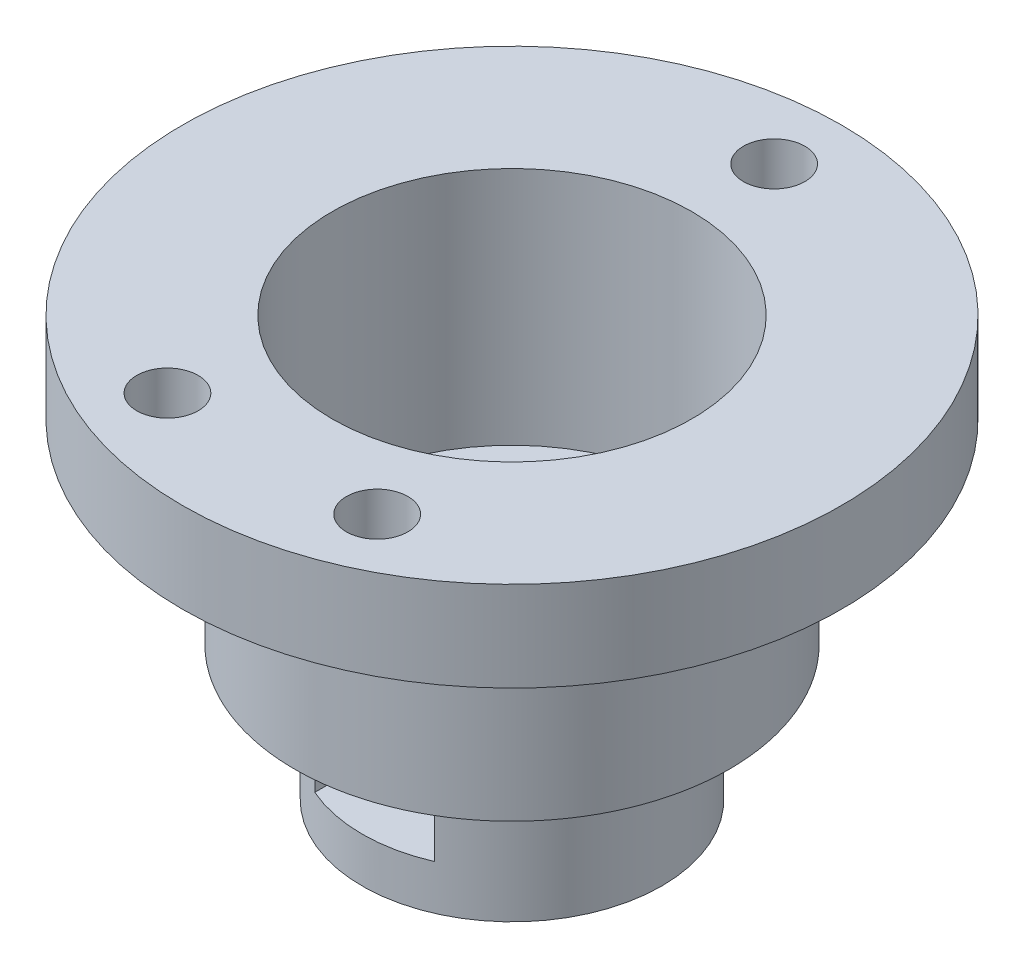
ISO-10303-21;
HEADER;
FILE_DESCRIPTION(('STEP AP214'),'2;1');
FILE_NAME('part.step','',(''),(''),'','','');
FILE_SCHEMA(('AUTOMOTIVE_DESIGN { 1 0 10303 214 1 1 1 1 }'));
ENDSEC;
DATA;
#1=APPLICATION_CONTEXT('core data for automotive mechanical design processes');
#2=APPLICATION_PROTOCOL_DEFINITION('international standard','automotive_design',2000,#1);
#3=PRODUCT_CONTEXT('',#1,'mechanical');
#4=PRODUCT('Part','Part','',(#3));
#5=PRODUCT_RELATED_PRODUCT_CATEGORY('part','',(#4));
#6=PRODUCT_DEFINITION_FORMATION('','',#4);
#7=PRODUCT_DEFINITION_CONTEXT('part definition',#1,'design');
#8=PRODUCT_DEFINITION('design','',#6,#7);
#9=PRODUCT_DEFINITION_SHAPE('','',#8);
#10=(LENGTH_UNIT() NAMED_UNIT(*) SI_UNIT(.MILLI.,.METRE.));
#11=(NAMED_UNIT(*) PLANE_ANGLE_UNIT() SI_UNIT($,.RADIAN.));
#12=(NAMED_UNIT(*) SI_UNIT($,.STERADIAN.) SOLID_ANGLE_UNIT());
#13=UNCERTAINTY_MEASURE_WITH_UNIT(LENGTH_MEASURE(1.E-05),#10,'distance_accuracy_value','');
#14=(GEOMETRIC_REPRESENTATION_CONTEXT(3) GLOBAL_UNCERTAINTY_ASSIGNED_CONTEXT((#13)) GLOBAL_UNIT_ASSIGNED_CONTEXT((#10,
#11,#12)) REPRESENTATION_CONTEXT('',''));
#15=CARTESIAN_POINT('',(0.,0.,0.));
#16=DIRECTION('',(0.,0.,1.));
#17=DIRECTION('',(1.,0.,0.));
#18=AXIS2_PLACEMENT_3D('',#15,#16,#17);
#19=CARTESIAN_POINT('',(0.,9.,0.));
#20=DIRECTION('',(0.,-1.,0.));
#21=DIRECTION('',(0.,0.,-1.));
#22=AXIS2_PLACEMENT_3D('',#19,#20,#21);
#23=CYLINDRICAL_SURFACE('',#22,10.);
#24=CARTESIAN_POINT('',(0.,9.,0.));
#25=DIRECTION('',(0.,1.,0.));
#26=DIRECTION('',(0.,0.,1.));
#27=AXIS2_PLACEMENT_3D('',#24,#25,#26);
#28=CIRCLE('',#27,10.);
#29=CARTESIAN_POINT('',(-9.88685996664259,9.,1.5));
#30=VERTEX_POINT('',#29);
#31=CARTESIAN_POINT('',(-9.88685996664259,9.,-1.5));
#32=VERTEX_POINT('',#31);
#33=EDGE_CURVE('E198',#30,#32,#28,.T.);
#34=ORIENTED_EDGE('',*,*,#33,.F.);
#35=DIRECTION('',(0.,-1.,0.));
#36=VECTOR('',#35,1.);
#37=CARTESIAN_POINT('',(-9.88685996664259,22.002,1.5));
#38=LINE('',#37,#36);
#39=CARTESIAN_POINT('',(-9.88685996664259,0.,1.5));
#40=VERTEX_POINT('',#39);
#41=EDGE_CURVE('E171',#30,#40,#38,.T.);
#42=ORIENTED_EDGE('',*,*,#41,.T.);
#43=CARTESIAN_POINT('',(0.,0.,0.));
#44=DIRECTION('',(0.,1.,0.));
#45=DIRECTION('',(0.,0.,1.));
#46=AXIS2_PLACEMENT_3D('',#43,#44,#45);
#47=CIRCLE('',#46,10.);
#48=CARTESIAN_POINT('',(-9.88685996664259,0.,-1.5));
#49=VERTEX_POINT('',#48);
#50=EDGE_CURVE('E197',#40,#49,#47,.T.);
#51=ORIENTED_EDGE('',*,*,#50,.T.);
#52=DIRECTION('',(0.,-1.,0.));
#53=VECTOR('',#52,1.);
#54=CARTESIAN_POINT('',(-9.88685996664259,22.002,-1.5));
#55=LINE('',#54,#53);
#56=EDGE_CURVE('E175',#32,#49,#55,.T.);
#57=ORIENTED_EDGE('',*,*,#56,.F.);
#58=EDGE_LOOP('',(#34,#42,#51,#57));
#59=FACE_BOUND('',#58,.T.);
#60=CARTESIAN_POINT('',(0.,6.8,0.));
#61=DIRECTION('',(0.,-1.,0.));
#62=DIRECTION('',(0.,0.,-1.));
#63=AXIS2_PLACEMENT_3D('',#60,#61,#62);
#64=CIRCLE('',#63,10.);
#65=CARTESIAN_POINT('',(4.,6.8,9.16515138991168));
#66=VERTEX_POINT('',#65);
#67=CARTESIAN_POINT('',(-4.,6.8,9.16515138991168));
#68=VERTEX_POINT('',#67);
#69=EDGE_CURVE('E129',#66,#68,#64,.T.);
#70=ORIENTED_EDGE('',*,*,#69,.F.);
#71=DIRECTION('',(0.,-1.,0.));
#72=VECTOR('',#71,1.);
#73=CARTESIAN_POINT('',(4.,6.8,9.16515138991168));
#74=LINE('',#73,#72);
#75=CARTESIAN_POINT('',(4.,3.,9.16515138991168));
#76=VERTEX_POINT('',#75);
#77=EDGE_CURVE('E111',#66,#76,#74,.T.);
#78=ORIENTED_EDGE('',*,*,#77,.T.);
#79=CARTESIAN_POINT('',(0.,3.,0.));
#80=DIRECTION('',(0.,-1.,0.));
#81=DIRECTION('',(0.,0.,-1.));
#82=AXIS2_PLACEMENT_3D('',#79,#80,#81);
#83=CIRCLE('',#82,10.);
#84=CARTESIAN_POINT('',(-4.,3.,9.16515138991168));
#85=VERTEX_POINT('',#84);
#86=EDGE_CURVE('E144',#76,#85,#83,.T.);
#87=ORIENTED_EDGE('',*,*,#86,.T.);
#88=DIRECTION('',(0.,-1.,0.));
#89=VECTOR('',#88,1.);
#90=CARTESIAN_POINT('',(-4.,6.8,9.16515138991168));
#91=LINE('',#90,#89);
#92=EDGE_CURVE('E121',#68,#85,#91,.T.);
#93=ORIENTED_EDGE('',*,*,#92,.F.);
#94=EDGE_LOOP('',(#70,#78,#87,#93));
#95=FACE_BOUND('',#94,.T.);
#96=ADVANCED_FACE('F34',(#59,#95),#23,.T.);
#97=CARTESIAN_POINT('',(0.,0.,0.));
#98=DIRECTION('',(0.,1.,0.));
#99=DIRECTION('',(0.,0.,1.));
#100=AXIS2_PLACEMENT_3D('',#97,#98,#99);
#101=CYLINDRICAL_SURFACE('',#100,3.);
#102=CARTESIAN_POINT('',(0.,12.,0.));
#103=DIRECTION('',(0.,1.,0.));
#104=DIRECTION('',(0.,0.,1.));
#105=AXIS2_PLACEMENT_3D('',#102,#103,#104);
#106=CIRCLE('',#105,3.);
#107=CARTESIAN_POINT('',(0.,12.,3.));
#108=VERTEX_POINT('',#107);
#109=EDGE_CURVE('E185',#108,#108,#106,.T.);
#110=ORIENTED_EDGE('',*,*,#109,.T.);
#111=EDGE_LOOP('',(#110));
#112=FACE_BOUND('',#111,.T.);
#113=CARTESIAN_POINT('',(0.,6.8,0.));
#114=DIRECTION('',(0.,-1.,0.));
#115=DIRECTION('',(0.,0.,-1.));
#116=AXIS2_PLACEMENT_3D('',#113,#114,#115);
#117=CIRCLE('',#116,3.);
#118=CARTESIAN_POINT('',(0.,6.8,-3.));
#119=VERTEX_POINT('',#118);
#120=EDGE_CURVE('E37',#119,#119,#117,.F.);
#121=ORIENTED_EDGE('',*,*,#120,.F.);
#122=EDGE_LOOP('',(#121));
#123=FACE_BOUND('',#122,.T.);
#124=ADVANCED_FACE('F210',(#112,#123),#101,.F.);
#125=CARTESIAN_POINT('',(0.,0.,0.));
#126=DIRECTION('',(0.,1.,0.));
#127=DIRECTION('',(0.,0.,1.));
#128=AXIS2_PLACEMENT_3D('',#125,#126,#127);
#129=PLANE('',#128);
#130=CARTESIAN_POINT('',(0.,0.,0.));
#131=DIRECTION('',(0.,1.,0.));
#132=DIRECTION('',(0.,0.,1.));
#133=AXIS2_PLACEMENT_3D('',#130,#131,#132);
#134=CIRCLE('',#133,3.);
#135=CARTESIAN_POINT('',(0.,0.,3.));
#136=VERTEX_POINT('',#135);
#137=EDGE_CURVE('E186',#136,#136,#134,.T.);
#138=ORIENTED_EDGE('',*,*,#137,.T.);
#139=EDGE_LOOP('',(#138));
#140=FACE_BOUND('',#139,.T.);
#141=ORIENTED_EDGE('',*,*,#50,.F.);
#142=DIRECTION('',(-1.,0.,0.));
#143=VECTOR('',#142,1.);
#144=CARTESIAN_POINT('',(0.,0.,1.5));
#145=LINE('',#144,#143);
#146=CARTESIAN_POINT('',(-13.,0.,1.5));
#147=VERTEX_POINT('',#146);
#148=EDGE_CURVE('E164',#40,#147,#145,.T.);
#149=ORIENTED_EDGE('',*,*,#148,.T.);
#150=CARTESIAN_POINT('',(-13.,0.,0.));
#151=DIRECTION('',(0.,-1.,0.));
#152=DIRECTION('',(0.,0.,-1.));
#153=AXIS2_PLACEMENT_3D('',#150,#151,#152);
#154=CIRCLE('',#153,1.5);
#155=CARTESIAN_POINT('',(-13.,0.,-1.5));
#156=VERTEX_POINT('',#155);
#157=EDGE_CURVE('E161',#147,#156,#154,.T.);
#158=ORIENTED_EDGE('',*,*,#157,.T.);
#159=DIRECTION('',(-1.,0.,0.));
#160=VECTOR('',#159,1.);
#161=CARTESIAN_POINT('',(0.,0.,-1.5));
#162=LINE('',#161,#160);
#163=EDGE_CURVE('E165',#49,#156,#162,.T.);
#164=ORIENTED_EDGE('',*,*,#163,.F.);
#165=EDGE_LOOP('',(#141,#149,#158,#164));
#166=FACE_BOUND('',#165,.T.);
#167=ADVANCED_FACE('F212',(#140,#166),#129,.F.);
#168=CARTESIAN_POINT('',(0.,12.,0.));
#169=DIRECTION('',(0.,-1.,0.));
#170=DIRECTION('',(0.,0.,-1.));
#171=AXIS2_PLACEMENT_3D('',#168,#169,#170);
#172=CYLINDRICAL_SURFACE('',#171,14.5);
#173=CARTESIAN_POINT('',(0.,9.,0.));
#174=DIRECTION('',(0.,1.,0.));
#175=DIRECTION('',(0.,0.,1.));
#176=AXIS2_PLACEMENT_3D('',#173,#174,#175);
#177=CIRCLE('',#176,14.5);
#178=CARTESIAN_POINT('',(-14.5,9.,0.));
#179=VERTEX_POINT('',#178);
#180=EDGE_CURVE('E194',#179,#179,#177,.T.);
#181=ORIENTED_EDGE('',*,*,#180,.T.);
#182=EDGE_LOOP('',(#181));
#183=FACE_BOUND('',#182,.T.);
#184=CARTESIAN_POINT('',(0.,22.,0.));
#185=DIRECTION('',(0.,1.,0.));
#186=DIRECTION('',(0.,0.,1.));
#187=AXIS2_PLACEMENT_3D('',#184,#185,#186);
#188=CIRCLE('',#187,14.5);
#189=CARTESIAN_POINT('',(0.,22.,14.5));
#190=VERTEX_POINT('',#189);
#191=EDGE_CURVE('E189',#190,#190,#188,.T.);
#192=ORIENTED_EDGE('',*,*,#191,.F.);
#193=EDGE_LOOP('',(#192));
#194=FACE_BOUND('',#193,.T.);
#195=ADVANCED_FACE('F220',(#183,#194),#172,.T.);
#196=CARTESIAN_POINT('',(0.,9.,0.));
#197=DIRECTION('',(0.,1.,0.));
#198=DIRECTION('',(0.,0.,1.));
#199=AXIS2_PLACEMENT_3D('',#196,#197,#198);
#200=PLANE('',#199);
#201=CARTESIAN_POINT('',(-13.,9.,0.));
#202=DIRECTION('',(0.,1.,0.));
#203=DIRECTION('',(0.,0.,1.));
#204=AXIS2_PLACEMENT_3D('',#201,#202,#203);
#205=CIRCLE('',#204,1.5);
#206=CARTESIAN_POINT('',(-13.,9.,1.5));
#207=VERTEX_POINT('',#206);
#208=EDGE_CURVE('E180',#207,#179,#205,.F.);
#209=ORIENTED_EDGE('',*,*,#208,.F.);
#210=DIRECTION('',(-1.,0.,0.));
#211=VECTOR('',#210,1.);
#212=CARTESIAN_POINT('',(0.,9.,1.5));
#213=LINE('',#212,#211);
#214=EDGE_CURVE('E174',#30,#207,#213,.T.);
#215=ORIENTED_EDGE('',*,*,#214,.F.);
#216=ORIENTED_EDGE('',*,*,#33,.T.);
#217=DIRECTION('',(-1.,0.,0.));
#218=VECTOR('',#217,1.);
#219=CARTESIAN_POINT('',(0.,9.,-1.5));
#220=LINE('',#219,#218);
#221=CARTESIAN_POINT('',(-13.,9.,-1.5));
#222=VERTEX_POINT('',#221);
#223=EDGE_CURVE('E182',#32,#222,#220,.T.);
#224=ORIENTED_EDGE('',*,*,#223,.T.);
#225=CARTESIAN_POINT('',(-13.,9.,0.));
#226=DIRECTION('',(0.,1.,0.));
#227=DIRECTION('',(0.,0.,1.));
#228=AXIS2_PLACEMENT_3D('',#225,#226,#227);
#229=CIRCLE('',#228,1.5);
#230=EDGE_CURVE('E11',#222,#179,#229,.T.);
#231=ORIENTED_EDGE('',*,*,#230,.T.);
#232=ORIENTED_EDGE('',*,*,#180,.F.);
#233=EDGE_LOOP('',(#209,#215,#216,#224,#231,#232));
#234=FACE_BOUND('',#233,.T.);
#235=ADVANCED_FACE('F338',(#234),#200,.F.);
#236=CARTESIAN_POINT('',(0.,22.,0.));
#237=DIRECTION('',(0.,-1.,0.));
#238=DIRECTION('',(0.,0.,-1.));
#239=AXIS2_PLACEMENT_3D('',#236,#237,#238);
#240=CYLINDRICAL_SURFACE('',#239,12.);
#241=CARTESIAN_POINT('',(0.,12.,0.));
#242=DIRECTION('',(0.,1.,0.));
#243=DIRECTION('',(0.,0.,1.));
#244=AXIS2_PLACEMENT_3D('',#241,#242,#243);
#245=CIRCLE('',#244,12.);
#246=CARTESIAN_POINT('',(0.,12.,12.));
#247=VERTEX_POINT('',#246);
#248=EDGE_CURVE('E42',#247,#247,#245,.F.);
#249=ORIENTED_EDGE('',*,*,#248,.T.);
#250=EDGE_LOOP('',(#249));
#251=FACE_BOUND('',#250,.T.);
#252=CARTESIAN_POINT('',(0.,28.,0.));
#253=DIRECTION('',(0.,1.,0.));
#254=DIRECTION('',(0.,0.,1.));
#255=AXIS2_PLACEMENT_3D('',#252,#253,#254);
#256=CIRCLE('',#255,12.);
#257=CARTESIAN_POINT('',(0.,28.,12.));
#258=VERTEX_POINT('',#257);
#259=EDGE_CURVE('E306',#258,#258,#256,.T.);
#260=ORIENTED_EDGE('',*,*,#259,.T.);
#261=EDGE_LOOP('',(#260));
#262=FACE_BOUND('',#261,.T.);
#263=ADVANCED_FACE('F236',(#251,#262),#240,.F.);
#264=CARTESIAN_POINT('',(0.,12.,0.));
#265=DIRECTION('',(0.,1.,0.));
#266=DIRECTION('',(0.,0.,1.));
#267=AXIS2_PLACEMENT_3D('',#264,#265,#266);
#268=PLANE('',#267);
#269=ORIENTED_EDGE('',*,*,#109,.F.);
#270=EDGE_LOOP('',(#269));
#271=FACE_BOUND('',#270,.T.);
#272=ORIENTED_EDGE('',*,*,#248,.F.);
#273=EDGE_LOOP('',(#272));
#274=FACE_BOUND('',#273,.T.);
#275=ADVANCED_FACE('F227',(#271,#274),#268,.T.);
#276=CARTESIAN_POINT('',(0.,3.,0.));
#277=DIRECTION('',(0.,-1.,0.));
#278=DIRECTION('',(0.,0.,-1.));
#279=AXIS2_PLACEMENT_3D('',#276,#277,#278);
#280=CIRCLE('',#279,3.);
#281=CARTESIAN_POINT('',(0.,3.,-3.));
#282=VERTEX_POINT('',#281);
#283=EDGE_CURVE('E155',#282,#282,#280,.F.);
#284=ORIENTED_EDGE('',*,*,#283,.T.);
#285=EDGE_LOOP('',(#284));
#286=FACE_BOUND('',#285,.T.);
#287=ORIENTED_EDGE('',*,*,#137,.F.);
#288=EDGE_LOOP('',(#287));
#289=FACE_BOUND('',#288,.T.);
#290=ADVANCED_FACE('F215',(#286,#289),#101,.F.);
#291=CARTESIAN_POINT('',(0.,22.002,1.5));
#292=DIRECTION('',(0.,0.,1.));
#293=DIRECTION('',(1.,0.,0.));
#294=AXIS2_PLACEMENT_3D('',#291,#292,#293);
#295=PLANE('',#294);
#296=ORIENTED_EDGE('',*,*,#41,.F.);
#297=ORIENTED_EDGE('',*,*,#214,.T.);
#298=DIRECTION('',(0.,-1.,0.));
#299=VECTOR('',#298,1.);
#300=CARTESIAN_POINT('',(-13.,22.002,1.5));
#301=LINE('',#300,#299);
#302=EDGE_CURVE('E58',#207,#147,#301,.T.);
#303=ORIENTED_EDGE('',*,*,#302,.T.);
#304=ORIENTED_EDGE('',*,*,#148,.F.);
#305=EDGE_LOOP('',(#296,#297,#303,#304));
#306=FACE_BOUND('',#305,.T.);
#307=ADVANCED_FACE('F226',(#306),#295,.T.);
#308=CARTESIAN_POINT('',(0.,22.002,-1.5));
#309=DIRECTION('',(0.,0.,1.));
#310=DIRECTION('',(1.,0.,0.));
#311=AXIS2_PLACEMENT_3D('',#308,#309,#310);
#312=PLANE('',#311);
#313=ORIENTED_EDGE('',*,*,#223,.F.);
#314=ORIENTED_EDGE('',*,*,#56,.T.);
#315=ORIENTED_EDGE('',*,*,#163,.T.);
#316=DIRECTION('',(0.,-1.,0.));
#317=VECTOR('',#316,1.);
#318=CARTESIAN_POINT('',(-13.,22.002,-1.5));
#319=LINE('',#318,#317);
#320=EDGE_CURVE('E172',#222,#156,#319,.T.);
#321=ORIENTED_EDGE('',*,*,#320,.F.);
#322=EDGE_LOOP('',(#313,#314,#315,#321));
#323=FACE_BOUND('',#322,.T.);
#324=ADVANCED_FACE('F233',(#323),#312,.F.);
#325=CARTESIAN_POINT('',(-13.,22.002,0.));
#326=DIRECTION('',(0.,-1.,0.));
#327=DIRECTION('',(0.,0.,-1.));
#328=AXIS2_PLACEMENT_3D('',#325,#326,#327);
#329=CYLINDRICAL_SURFACE('',#328,1.5);
#330=ORIENTED_EDGE('',*,*,#208,.T.);
#331=ORIENTED_EDGE('',*,*,#230,.F.);
#332=ORIENTED_EDGE('',*,*,#320,.T.);
#333=ORIENTED_EDGE('',*,*,#157,.F.);
#334=ORIENTED_EDGE('',*,*,#302,.F.);
#335=EDGE_LOOP('',(#330,#331,#332,#333,#334));
#336=FACE_BOUND('',#335,.T.);
#337=ADVANCED_FACE('F228',(#336),#329,.T.);
#338=CARTESIAN_POINT('',(0.,6.8,0.));
#339=DIRECTION('',(0.,-1.,0.));
#340=DIRECTION('',(0.,0.,-1.));
#341=AXIS2_PLACEMENT_3D('',#338,#339,#340);
#342=PLANE('',#341);
#343=DIRECTION('',(0.,0.,1.));
#344=VECTOR('',#343,1.);
#345=CARTESIAN_POINT('',(4.,6.8,0.));
#346=LINE('',#345,#344);
#347=CARTESIAN_POINT('',(4.,6.8,-2.3094010767585));
#348=VERTEX_POINT('',#347);
#349=EDGE_CURVE('E114',#348,#66,#346,.T.);
#350=ORIENTED_EDGE('',*,*,#349,.T.);
#351=ORIENTED_EDGE('',*,*,#69,.T.);
#352=DIRECTION('',(0.,0.,-1.));
#353=VECTOR('',#352,1.);
#354=CARTESIAN_POINT('',(-4.,6.8,0.));
#355=LINE('',#354,#353);
#356=CARTESIAN_POINT('',(-4.,6.8,-2.3094010767585));
#357=VERTEX_POINT('',#356);
#358=EDGE_CURVE('E135',#68,#357,#355,.T.);
#359=ORIENTED_EDGE('',*,*,#358,.T.);
#360=DIRECTION('',(0.866025403784438,0.,-0.5));
#361=VECTOR('',#360,1.);
#362=CARTESIAN_POINT('',(-2.,6.8,-3.46410161513776));
#363=LINE('',#362,#361);
#364=CARTESIAN_POINT('',(0.,6.8,-4.61880215351701));
#365=VERTEX_POINT('',#364);
#366=EDGE_CURVE('E137',#357,#365,#363,.T.);
#367=ORIENTED_EDGE('',*,*,#366,.T.);
#368=DIRECTION('',(0.866025403784439,0.,0.5));
#369=VECTOR('',#368,1.);
#370=CARTESIAN_POINT('',(2.,6.8,-3.46410161513776));
#371=LINE('',#370,#369);
#372=EDGE_CURVE('E122',#365,#348,#371,.T.);
#373=ORIENTED_EDGE('',*,*,#372,.T.);
#374=EDGE_LOOP('',(#350,#351,#359,#367,#373));
#375=FACE_BOUND('',#374,.T.);
#376=ORIENTED_EDGE('',*,*,#120,.T.);
#377=EDGE_LOOP('',(#376));
#378=FACE_BOUND('',#377,.T.);
#379=ADVANCED_FACE('F126',(#375,#378),#342,.T.);
#380=CARTESIAN_POINT('',(0.,3.,0.));
#381=DIRECTION('',(0.,-1.,0.));
#382=DIRECTION('',(0.,0.,-1.));
#383=AXIS2_PLACEMENT_3D('',#380,#381,#382);
#384=PLANE('',#383);
#385=DIRECTION('',(0.,0.,1.));
#386=VECTOR('',#385,1.);
#387=CARTESIAN_POINT('',(4.,3.,0.));
#388=LINE('',#387,#386);
#389=CARTESIAN_POINT('',(4.,3.,-2.3094010767585));
#390=VERTEX_POINT('',#389);
#391=EDGE_CURVE('E117',#390,#76,#388,.T.);
#392=ORIENTED_EDGE('',*,*,#391,.F.);
#393=DIRECTION('',(0.866025403784439,0.,0.5));
#394=VECTOR('',#393,1.);
#395=CARTESIAN_POINT('',(2.,3.,-3.46410161513776));
#396=LINE('',#395,#394);
#397=CARTESIAN_POINT('',(0.,3.,-4.61880215351701));
#398=VERTEX_POINT('',#397);
#399=EDGE_CURVE('E133',#398,#390,#396,.T.);
#400=ORIENTED_EDGE('',*,*,#399,.F.);
#401=DIRECTION('',(0.866025403784438,0.,-0.5));
#402=VECTOR('',#401,1.);
#403=CARTESIAN_POINT('',(-2.,3.,-3.46410161513776));
#404=LINE('',#403,#402);
#405=CARTESIAN_POINT('',(-4.,3.,-2.3094010767585));
#406=VERTEX_POINT('',#405);
#407=EDGE_CURVE('E148',#406,#398,#404,.T.);
#408=ORIENTED_EDGE('',*,*,#407,.F.);
#409=DIRECTION('',(0.,0.,-1.));
#410=VECTOR('',#409,1.);
#411=CARTESIAN_POINT('',(-4.,3.,0.));
#412=LINE('',#411,#410);
#413=EDGE_CURVE('E50',#85,#406,#412,.T.);
#414=ORIENTED_EDGE('',*,*,#413,.F.);
#415=ORIENTED_EDGE('',*,*,#86,.F.);
#416=EDGE_LOOP('',(#392,#400,#408,#414,#415));
#417=FACE_BOUND('',#416,.T.);
#418=ORIENTED_EDGE('',*,*,#283,.F.);
#419=EDGE_LOOP('',(#418));
#420=FACE_BOUND('',#419,.T.);
#421=ADVANCED_FACE('F246',(#417,#420),#384,.F.);
#422=CARTESIAN_POINT('',(4.,6.8,0.));
#423=DIRECTION('',(1.,0.,0.));
#424=DIRECTION('',(0.,0.,-1.));
#425=AXIS2_PLACEMENT_3D('',#422,#423,#424);
#426=PLANE('',#425);
#427=ORIENTED_EDGE('',*,*,#391,.T.);
#428=ORIENTED_EDGE('',*,*,#77,.F.);
#429=ORIENTED_EDGE('',*,*,#349,.F.);
#430=DIRECTION('',(0.,-1.,0.));
#431=VECTOR('',#430,1.);
#432=CARTESIAN_POINT('',(4.,6.8,-2.3094010767585));
#433=LINE('',#432,#431);
#434=EDGE_CURVE('E153',#348,#390,#433,.T.);
#435=ORIENTED_EDGE('',*,*,#434,.T.);
#436=EDGE_LOOP('',(#427,#428,#429,#435));
#437=FACE_BOUND('',#436,.T.);
#438=ADVANCED_FACE('F113',(#437),#426,.F.);
#439=CARTESIAN_POINT('',(2.,6.8,-3.46410161513776));
#440=DIRECTION('',(0.5,0.,-0.866025403784439));
#441=DIRECTION('',(-0.866025403784439,0.,-0.5));
#442=AXIS2_PLACEMENT_3D('',#439,#440,#441);
#443=PLANE('',#442);
#444=ORIENTED_EDGE('',*,*,#399,.T.);
#445=ORIENTED_EDGE('',*,*,#434,.F.);
#446=ORIENTED_EDGE('',*,*,#372,.F.);
#447=DIRECTION('',(0.,-1.,0.));
#448=VECTOR('',#447,1.);
#449=CARTESIAN_POINT('',(0.,6.8,-4.61880215351701));
#450=LINE('',#449,#448);
#451=EDGE_CURVE('E156',#365,#398,#450,.T.);
#452=ORIENTED_EDGE('',*,*,#451,.T.);
#453=EDGE_LOOP('',(#444,#445,#446,#452));
#454=FACE_BOUND('',#453,.T.);
#455=ADVANCED_FACE('F252',(#454),#443,.F.);
#456=CARTESIAN_POINT('',(-2.,6.8,-3.46410161513776));
#457=DIRECTION('',(-0.5,0.,-0.866025403784438));
#458=DIRECTION('',(-0.866025403784439,0.,0.5));
#459=AXIS2_PLACEMENT_3D('',#456,#457,#458);
#460=PLANE('',#459);
#461=ORIENTED_EDGE('',*,*,#407,.T.);
#462=ORIENTED_EDGE('',*,*,#451,.F.);
#463=ORIENTED_EDGE('',*,*,#366,.F.);
#464=DIRECTION('',(0.,-1.,0.));
#465=VECTOR('',#464,1.);
#466=CARTESIAN_POINT('',(-4.,6.8,-2.3094010767585));
#467=LINE('',#466,#465);
#468=EDGE_CURVE('E158',#357,#406,#467,.T.);
#469=ORIENTED_EDGE('',*,*,#468,.T.);
#470=EDGE_LOOP('',(#461,#462,#463,#469));
#471=FACE_BOUND('',#470,.T.);
#472=ADVANCED_FACE('F257',(#471),#460,.F.);
#473=CARTESIAN_POINT('',(-4.,6.8,0.));
#474=DIRECTION('',(-1.,0.,0.));
#475=DIRECTION('',(0.,0.,1.));
#476=AXIS2_PLACEMENT_3D('',#473,#474,#475);
#477=PLANE('',#476);
#478=ORIENTED_EDGE('',*,*,#413,.T.);
#479=ORIENTED_EDGE('',*,*,#468,.F.);
#480=ORIENTED_EDGE('',*,*,#358,.F.);
#481=ORIENTED_EDGE('',*,*,#92,.T.);
#482=EDGE_LOOP('',(#478,#479,#480,#481));
#483=FACE_BOUND('',#482,.T.);
#484=ADVANCED_FACE('F253',(#483),#477,.F.);
#485=CARTESIAN_POINT('',(0.,28.,0.));
#486=DIRECTION('',(0.,1.,0.));
#487=DIRECTION('',(0.,0.,1.));
#488=AXIS2_PLACEMENT_3D('',#485,#486,#487);
#489=PLANE('',#488);
#490=CARTESIAN_POINT('',(0.,28.,-17.5));
#491=DIRECTION('',(0.,1.,0.));
#492=DIRECTION('',(0.,0.,1.));
#493=AXIS2_PLACEMENT_3D('',#490,#491,#492);
#494=CIRCLE('',#493,2.05);
#495=CARTESIAN_POINT('',(0.,28.,-15.45));
#496=VERTEX_POINT('',#495);
#497=EDGE_CURVE('E307',#496,#496,#494,.T.);
#498=ORIENTED_EDGE('',*,*,#497,.F.);
#499=EDGE_LOOP('',(#498));
#500=FACE_BOUND('',#499,.T.);
#501=CARTESIAN_POINT('',(-7.,28.,16.));
#502=DIRECTION('',(0.,1.,0.));
#503=DIRECTION('',(0.,0.,1.));
#504=AXIS2_PLACEMENT_3D('',#501,#502,#503);
#505=CIRCLE('',#504,2.05);
#506=CARTESIAN_POINT('',(-7.,28.,18.05));
#507=VERTEX_POINT('',#506);
#508=EDGE_CURVE('E318',#507,#507,#505,.T.);
#509=ORIENTED_EDGE('',*,*,#508,.F.);
#510=EDGE_LOOP('',(#509));
#511=FACE_BOUND('',#510,.T.);
#512=CARTESIAN_POINT('',(7.,28.,16.));
#513=DIRECTION('',(0.,1.,0.));
#514=DIRECTION('',(0.,0.,1.));
#515=AXIS2_PLACEMENT_3D('',#512,#513,#514);
#516=CIRCLE('',#515,2.05);
#517=CARTESIAN_POINT('',(7.,28.,18.05));
#518=VERTEX_POINT('',#517);
#519=EDGE_CURVE('E324',#518,#518,#516,.T.);
#520=ORIENTED_EDGE('',*,*,#519,.F.);
#521=EDGE_LOOP('',(#520));
#522=FACE_BOUND('',#521,.T.);
#523=CARTESIAN_POINT('',(0.,28.,0.));
#524=DIRECTION('',(0.,1.,0.));
#525=DIRECTION('',(0.,0.,1.));
#526=AXIS2_PLACEMENT_3D('',#523,#524,#525);
#527=CIRCLE('',#526,22.);
#528=CARTESIAN_POINT('',(0.,28.,22.));
#529=VERTEX_POINT('',#528);
#530=EDGE_CURVE('E145',#529,#529,#527,.T.);
#531=ORIENTED_EDGE('',*,*,#530,.T.);
#532=EDGE_LOOP('',(#531));
#533=FACE_BOUND('',#532,.T.);
#534=ORIENTED_EDGE('',*,*,#259,.F.);
#535=EDGE_LOOP('',(#534));
#536=FACE_BOUND('',#535,.T.);
#537=ADVANCED_FACE('F256',(#500,#511,#522,#533,#536),#489,.T.);
#538=CARTESIAN_POINT('',(0.,22.,0.));
#539=DIRECTION('',(0.,1.,0.));
#540=DIRECTION('',(0.,0.,1.));
#541=AXIS2_PLACEMENT_3D('',#538,#539,#540);
#542=PLANE('',#541);
#543=ORIENTED_EDGE('',*,*,#191,.T.);
#544=EDGE_LOOP('',(#543));
#545=FACE_BOUND('',#544,.T.);
#546=CARTESIAN_POINT('',(0.,22.,0.));
#547=DIRECTION('',(0.,1.,0.));
#548=DIRECTION('',(0.,0.,1.));
#549=AXIS2_PLACEMENT_3D('',#546,#547,#548);
#550=CIRCLE('',#549,22.);
#551=CARTESIAN_POINT('',(0.,22.,22.));
#552=VERTEX_POINT('',#551);
#553=EDGE_CURVE('E310',#552,#552,#550,.T.);
#554=ORIENTED_EDGE('',*,*,#553,.F.);
#555=EDGE_LOOP('',(#554));
#556=FACE_BOUND('',#555,.T.);
#557=ADVANCED_FACE('F271',(#545,#556),#542,.F.);
#558=CARTESIAN_POINT('',(0.,28.,0.));
#559=DIRECTION('',(0.,-1.,0.));
#560=DIRECTION('',(0.,0.,-1.));
#561=AXIS2_PLACEMENT_3D('',#558,#559,#560);
#562=CYLINDRICAL_SURFACE('',#561,22.);
#563=ORIENTED_EDGE('',*,*,#530,.F.);
#564=EDGE_LOOP('',(#563));
#565=FACE_BOUND('',#564,.T.);
#566=ORIENTED_EDGE('',*,*,#553,.T.);
#567=EDGE_LOOP('',(#566));
#568=FACE_BOUND('',#567,.T.);
#569=ADVANCED_FACE('F267',(#565,#568),#562,.T.);
#570=CARTESIAN_POINT('',(7.,23.,16.));
#571=DIRECTION('',(0.,1.,0.));
#572=DIRECTION('',(0.,0.,1.));
#573=AXIS2_PLACEMENT_3D('',#570,#571,#572);
#574=CYLINDRICAL_SURFACE('',#573,2.05);
#575=CARTESIAN_POINT('',(7.,23.,16.));
#576=DIRECTION('',(0.,1.,0.));
#577=DIRECTION('',(0.,0.,1.));
#578=AXIS2_PLACEMENT_3D('',#575,#576,#577);
#579=CIRCLE('',#578,2.05);
#580=CARTESIAN_POINT('',(7.,23.,18.05));
#581=VERTEX_POINT('',#580);
#582=EDGE_CURVE('E321',#581,#581,#579,.T.);
#583=ORIENTED_EDGE('',*,*,#582,.F.);
#584=EDGE_LOOP('',(#583));
#585=FACE_BOUND('',#584,.T.);
#586=ORIENTED_EDGE('',*,*,#519,.T.);
#587=EDGE_LOOP('',(#586));
#588=FACE_BOUND('',#587,.T.);
#589=ADVANCED_FACE('F270',(#585,#588),#574,.F.);
#590=CARTESIAN_POINT('',(7.,23.,16.));
#591=DIRECTION('',(0.,1.,0.));
#592=DIRECTION('',(0.,0.,1.));
#593=AXIS2_PLACEMENT_3D('',#590,#591,#592);
#594=PLANE('',#593);
#595=ORIENTED_EDGE('',*,*,#582,.T.);
#596=EDGE_LOOP('',(#595));
#597=FACE_BOUND('',#596,.T.);
#598=ADVANCED_FACE('F281',(#597),#594,.T.);
#599=CARTESIAN_POINT('',(-7.,23.,16.));
#600=DIRECTION('',(0.,1.,0.));
#601=DIRECTION('',(0.,0.,1.));
#602=AXIS2_PLACEMENT_3D('',#599,#600,#601);
#603=CYLINDRICAL_SURFACE('',#602,2.05);
#604=CARTESIAN_POINT('',(-7.,23.,16.));
#605=DIRECTION('',(0.,1.,0.));
#606=DIRECTION('',(0.,0.,1.));
#607=AXIS2_PLACEMENT_3D('',#604,#605,#606);
#608=CIRCLE('',#607,2.05);
#609=CARTESIAN_POINT('',(-7.,23.,18.05));
#610=VERTEX_POINT('',#609);
#611=EDGE_CURVE('E313',#610,#610,#608,.T.);
#612=ORIENTED_EDGE('',*,*,#611,.F.);
#613=EDGE_LOOP('',(#612));
#614=FACE_BOUND('',#613,.T.);
#615=ORIENTED_EDGE('',*,*,#508,.T.);
#616=EDGE_LOOP('',(#615));
#617=FACE_BOUND('',#616,.T.);
#618=ADVANCED_FACE('F285',(#614,#617),#603,.F.);
#619=CARTESIAN_POINT('',(-7.,23.,16.));
#620=DIRECTION('',(0.,1.,0.));
#621=DIRECTION('',(0.,0.,1.));
#622=AXIS2_PLACEMENT_3D('',#619,#620,#621);
#623=PLANE('',#622);
#624=ORIENTED_EDGE('',*,*,#611,.T.);
#625=EDGE_LOOP('',(#624));
#626=FACE_BOUND('',#625,.T.);
#627=ADVANCED_FACE('F289',(#626),#623,.T.);
#628=CARTESIAN_POINT('',(0.,23.,-17.5));
#629=DIRECTION('',(0.,1.,0.));
#630=DIRECTION('',(0.,0.,1.));
#631=AXIS2_PLACEMENT_3D('',#628,#629,#630);
#632=CYLINDRICAL_SURFACE('',#631,2.05);
#633=CARTESIAN_POINT('',(0.,23.,-17.5));
#634=DIRECTION('',(0.,1.,0.));
#635=DIRECTION('',(0.,0.,1.));
#636=AXIS2_PLACEMENT_3D('',#633,#634,#635);
#637=CIRCLE('',#636,2.05);
#638=CARTESIAN_POINT('',(0.,23.,-15.45));
#639=VERTEX_POINT('',#638);
#640=EDGE_CURVE('E305',#639,#639,#637,.T.);
#641=ORIENTED_EDGE('',*,*,#640,.F.);
#642=EDGE_LOOP('',(#641));
#643=FACE_BOUND('',#642,.T.);
#644=ORIENTED_EDGE('',*,*,#497,.T.);
#645=EDGE_LOOP('',(#644));
#646=FACE_BOUND('',#645,.T.);
#647=ADVANCED_FACE('F293',(#643,#646),#632,.F.);
#648=CARTESIAN_POINT('',(0.,23.,-17.5));
#649=DIRECTION('',(0.,1.,0.));
#650=DIRECTION('',(0.,0.,1.));
#651=AXIS2_PLACEMENT_3D('',#648,#649,#650);
#652=PLANE('',#651);
#653=ORIENTED_EDGE('',*,*,#640,.T.);
#654=EDGE_LOOP('',(#653));
#655=FACE_BOUND('',#654,.T.);
#656=ADVANCED_FACE('F297',(#655),#652,.T.);
#657=CLOSED_SHELL('',(#96,#124,#167,#195,#235,#263,#275,#290,#307,#324,#337,#379,#421,#438,#455,
#472,#484,#537,#557,#569,#589,#598,#618,#627,#647,#656));
#658=MANIFOLD_SOLID_BREP('B2',#657);
#659=ADVANCED_BREP_SHAPE_REPRESENTATION('',(#18,#658),#14);
#660=SHAPE_DEFINITION_REPRESENTATION(#9,#659);
ENDSEC;
END-ISO-10303-21;
